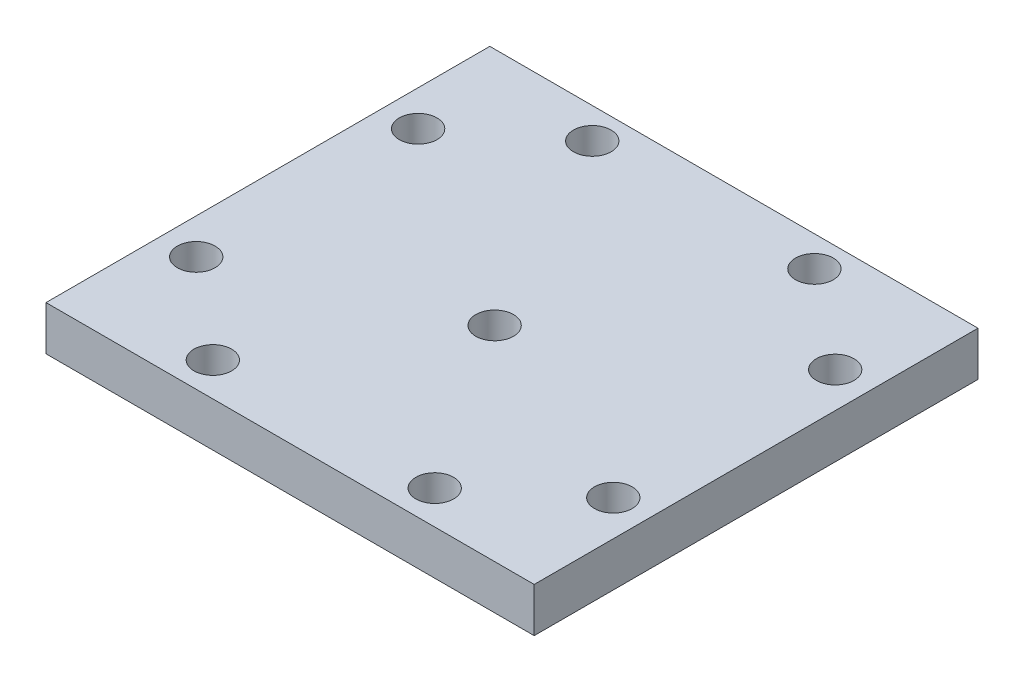
ISO-10303-21;
HEADER;
FILE_DESCRIPTION(('STEP AP214'),'2;1');
FILE_NAME('part.step','',(''),(''),'','','');
FILE_SCHEMA(('AUTOMOTIVE_DESIGN { 1 0 10303 214 1 1 1 1 }'));
ENDSEC;
DATA;
#1=APPLICATION_CONTEXT('core data for automotive mechanical design processes');
#2=APPLICATION_PROTOCOL_DEFINITION('international standard','automotive_design',2000,#1);
#3=PRODUCT_CONTEXT('',#1,'mechanical');
#4=PRODUCT('Part','Part','',(#3));
#5=PRODUCT_RELATED_PRODUCT_CATEGORY('part','',(#4));
#6=PRODUCT_DEFINITION_FORMATION('','',#4);
#7=PRODUCT_DEFINITION_CONTEXT('part definition',#1,'design');
#8=PRODUCT_DEFINITION('design','',#6,#7);
#9=PRODUCT_DEFINITION_SHAPE('','',#8);
#10=(LENGTH_UNIT() NAMED_UNIT(*) SI_UNIT(.MILLI.,.METRE.));
#11=(NAMED_UNIT(*) PLANE_ANGLE_UNIT() SI_UNIT($,.RADIAN.));
#12=(NAMED_UNIT(*) SI_UNIT($,.STERADIAN.) SOLID_ANGLE_UNIT());
#13=UNCERTAINTY_MEASURE_WITH_UNIT(LENGTH_MEASURE(1.E-05),#10,'distance_accuracy_value','');
#14=(GEOMETRIC_REPRESENTATION_CONTEXT(3) GLOBAL_UNCERTAINTY_ASSIGNED_CONTEXT((#13)) GLOBAL_UNIT_ASSIGNED_CONTEXT((#10,
#11,#12)) REPRESENTATION_CONTEXT('',''));
#15=CARTESIAN_POINT('',(0.,0.,0.));
#16=DIRECTION('',(0.,0.,1.));
#17=DIRECTION('',(1.,0.,0.));
#18=AXIS2_PLACEMENT_3D('',#15,#16,#17);
#19=CARTESIAN_POINT('',(0.,35.,0.));
#20=DIRECTION('',(0.,-1.,0.));
#21=DIRECTION('',(0.,0.,-1.));
#22=AXIS2_PLACEMENT_3D('',#19,#20,#21);
#23=PLANE('',#22);
#24=CARTESIAN_POINT('',(-23.4936005393496,35.,10.125));
#25=DIRECTION('',(0.,-1.,0.));
#26=DIRECTION('',(0.,0.,-1.));
#27=AXIS2_PLACEMENT_3D('',#24,#25,#26);
#28=CIRCLE('',#27,2.125);
#29=CARTESIAN_POINT('',(-23.4936005393496,35.,8.));
#30=VERTEX_POINT('',#29);
#31=EDGE_CURVE('E162',#30,#30,#28,.T.);
#32=ORIENTED_EDGE('',*,*,#31,.T.);
#33=EDGE_LOOP('',(#32));
#34=FACE_BOUND('',#33,.T.);
#35=CARTESIAN_POINT('',(12.5,35.,-23.5265194709854));
#36=DIRECTION('',(0.,-1.,0.));
#37=DIRECTION('',(0.,0.,-1.));
#38=AXIS2_PLACEMENT_3D('',#35,#36,#37);
#39=CIRCLE('',#38,2.125);
#40=CARTESIAN_POINT('',(12.5,35.,-25.6515194709854));
#41=VERTEX_POINT('',#40);
#42=EDGE_CURVE('E151',#41,#41,#39,.T.);
#43=ORIENTED_EDGE('',*,*,#42,.T.);
#44=EDGE_LOOP('',(#43));
#45=FACE_BOUND('',#44,.T.);
#46=CARTESIAN_POINT('',(-12.5,35.,-23.5));
#47=DIRECTION('',(0.,-1.,0.));
#48=DIRECTION('',(0.,0.,-1.));
#49=AXIS2_PLACEMENT_3D('',#46,#47,#48);
#50=CIRCLE('',#49,2.125);
#51=CARTESIAN_POINT('',(-12.5,35.,-25.625));
#52=VERTEX_POINT('',#51);
#53=EDGE_CURVE('E150',#52,#52,#50,.T.);
#54=ORIENTED_EDGE('',*,*,#53,.T.);
#55=EDGE_LOOP('',(#54));
#56=FACE_BOUND('',#55,.T.);
#57=CARTESIAN_POINT('',(12.5,35.,19.25));
#58=DIRECTION('',(0.,-1.,0.));
#59=DIRECTION('',(0.,0.,-1.));
#60=AXIS2_PLACEMENT_3D('',#57,#58,#59);
#61=CIRCLE('',#60,2.125);
#62=CARTESIAN_POINT('',(12.5,35.,17.125));
#63=VERTEX_POINT('',#62);
#64=EDGE_CURVE('E144',#63,#63,#61,.T.);
#65=ORIENTED_EDGE('',*,*,#64,.T.);
#66=EDGE_LOOP('',(#65));
#67=FACE_BOUND('',#66,.T.);
#68=CARTESIAN_POINT('',(-23.4936005393496,35.,-14.875));
#69=DIRECTION('',(0.,-1.,0.));
#70=DIRECTION('',(0.,0.,-1.));
#71=AXIS2_PLACEMENT_3D('',#68,#69,#70);
#72=CIRCLE('',#71,2.125);
#73=CARTESIAN_POINT('',(-23.4936005393496,35.,-17.));
#74=VERTEX_POINT('',#73);
#75=EDGE_CURVE('E163',#74,#74,#72,.T.);
#76=ORIENTED_EDGE('',*,*,#75,.T.);
#77=EDGE_LOOP('',(#76));
#78=FACE_BOUND('',#77,.T.);
#79=CARTESIAN_POINT('',(23.4936005393496,35.,-14.875));
#80=DIRECTION('',(0.,-1.,0.));
#81=DIRECTION('',(0.,0.,1.));
#82=AXIS2_PLACEMENT_3D('',#79,#80,#81);
#83=CIRCLE('',#82,2.125);
#84=CARTESIAN_POINT('',(23.4936005393496,35.,-12.75));
#85=VERTEX_POINT('',#84);
#86=EDGE_CURVE('E180',#85,#85,#83,.T.);
#87=ORIENTED_EDGE('',*,*,#86,.T.);
#88=EDGE_LOOP('',(#87));
#89=FACE_BOUND('',#88,.T.);
#90=CARTESIAN_POINT('',(23.4936005393496,35.,10.125));
#91=DIRECTION('',(0.,-1.,0.));
#92=DIRECTION('',(0.,0.,1.));
#93=AXIS2_PLACEMENT_3D('',#90,#91,#92);
#94=CIRCLE('',#93,2.125);
#95=CARTESIAN_POINT('',(23.4936005393496,35.,12.25));
#96=VERTEX_POINT('',#95);
#97=EDGE_CURVE('E174',#96,#96,#94,.T.);
#98=ORIENTED_EDGE('',*,*,#97,.T.);
#99=EDGE_LOOP('',(#98));
#100=FACE_BOUND('',#99,.T.);
#101=CARTESIAN_POINT('',(-12.5,35.,19.25));
#102=DIRECTION('',(0.,-1.,0.));
#103=DIRECTION('',(0.,0.,-1.));
#104=AXIS2_PLACEMENT_3D('',#101,#102,#103);
#105=CIRCLE('',#104,2.125);
#106=CARTESIAN_POINT('',(-12.5,35.,17.125));
#107=VERTEX_POINT('',#106);
#108=EDGE_CURVE('E138',#107,#107,#105,.T.);
#109=ORIENTED_EDGE('',*,*,#108,.T.);
#110=EDGE_LOOP('',(#109));
#111=FACE_BOUND('',#110,.T.);
#112=DIRECTION('',(0.,0.,-1.));
#113=VECTOR('',#112,1.);
#114=CARTESIAN_POINT('',(27.5,35.,23.0435212218331));
#115=LINE('',#114,#113);
#116=CARTESIAN_POINT('',(27.5,35.,23.0435212218331));
#117=VERTEX_POINT('',#116);
#118=CARTESIAN_POINT('',(27.5,35.,-26.9564787781669));
#119=VERTEX_POINT('',#118);
#120=EDGE_CURVE('E108',#117,#119,#115,.T.);
#121=ORIENTED_EDGE('',*,*,#120,.T.);
#122=DIRECTION('',(-1.,0.,0.));
#123=VECTOR('',#122,1.);
#124=CARTESIAN_POINT('',(-27.5,35.,-26.9564787781669));
#125=LINE('',#124,#123);
#126=CARTESIAN_POINT('',(-27.5,35.,-26.9564787781669));
#127=VERTEX_POINT('',#126);
#128=EDGE_CURVE('E103',#119,#127,#125,.T.);
#129=ORIENTED_EDGE('',*,*,#128,.T.);
#130=DIRECTION('',(0.,0.,1.));
#131=VECTOR('',#130,1.);
#132=CARTESIAN_POINT('',(-27.5,35.,23.0435212218331));
#133=LINE('',#132,#131);
#134=CARTESIAN_POINT('',(-27.5,35.,23.0435212218331));
#135=VERTEX_POINT('',#134);
#136=EDGE_CURVE('E106',#127,#135,#133,.T.);
#137=ORIENTED_EDGE('',*,*,#136,.T.);
#138=DIRECTION('',(1.,0.,0.));
#139=VECTOR('',#138,1.);
#140=CARTESIAN_POINT('',(-27.5,35.,23.0435212218331));
#141=LINE('',#140,#139);
#142=EDGE_CURVE('E73',#135,#117,#141,.T.);
#143=ORIENTED_EDGE('',*,*,#142,.T.);
#144=EDGE_LOOP('',(#121,#129,#137,#143));
#145=FACE_BOUND('',#144,.T.);
#146=CARTESIAN_POINT('',(0.,35.,0.));
#147=DIRECTION('',(0.,1.,0.));
#148=DIRECTION('',(0.,0.,1.));
#149=AXIS2_PLACEMENT_3D('',#146,#147,#148);
#150=CIRCLE('',#149,2.125);
#151=CARTESIAN_POINT('',(0.,35.,2.125));
#152=VERTEX_POINT('',#151);
#153=EDGE_CURVE('E123',#152,#152,#150,.T.);
#154=ORIENTED_EDGE('',*,*,#153,.F.);
#155=EDGE_LOOP('',(#154));
#156=FACE_BOUND('',#155,.T.);
#157=ADVANCED_FACE('F56',(#34,#45,#56,#67,#78,#89,#100,#111,#145,#156),#23,.F.);
#158=CARTESIAN_POINT('',(0.,30.,0.));
#159=DIRECTION('',(0.,-1.,0.));
#160=DIRECTION('',(0.,0.,-1.));
#161=AXIS2_PLACEMENT_3D('',#158,#159,#160);
#162=PLANE('',#161);
#163=CARTESIAN_POINT('',(-23.4936005393496,30.,10.125));
#164=DIRECTION('',(0.,-1.,0.));
#165=DIRECTION('',(0.,0.,-1.));
#166=AXIS2_PLACEMENT_3D('',#163,#164,#165);
#167=CIRCLE('',#166,2.125);
#168=CARTESIAN_POINT('',(-23.4936005393496,30.,8.));
#169=VERTEX_POINT('',#168);
#170=EDGE_CURVE('E159',#169,#169,#167,.T.);
#171=ORIENTED_EDGE('',*,*,#170,.F.);
#172=EDGE_LOOP('',(#171));
#173=FACE_BOUND('',#172,.T.);
#174=CARTESIAN_POINT('',(12.5,30.,-23.5265194709854));
#175=DIRECTION('',(0.,-1.,0.));
#176=DIRECTION('',(0.,0.,-1.));
#177=AXIS2_PLACEMENT_3D('',#174,#175,#176);
#178=CIRCLE('',#177,2.125);
#179=CARTESIAN_POINT('',(12.5,30.,-25.6515194709854));
#180=VERTEX_POINT('',#179);
#181=EDGE_CURVE('E166',#180,#180,#178,.T.);
#182=ORIENTED_EDGE('',*,*,#181,.F.);
#183=EDGE_LOOP('',(#182));
#184=FACE_BOUND('',#183,.T.);
#185=CARTESIAN_POINT('',(-12.5,30.,-23.5));
#186=DIRECTION('',(0.,-1.,0.));
#187=DIRECTION('',(0.,0.,-1.));
#188=AXIS2_PLACEMENT_3D('',#185,#186,#187);
#189=CIRCLE('',#188,2.125);
#190=CARTESIAN_POINT('',(-12.5,30.,-25.625));
#191=VERTEX_POINT('',#190);
#192=EDGE_CURVE('E147',#191,#191,#189,.T.);
#193=ORIENTED_EDGE('',*,*,#192,.F.);
#194=EDGE_LOOP('',(#193));
#195=FACE_BOUND('',#194,.T.);
#196=CARTESIAN_POINT('',(12.5,30.,19.25));
#197=DIRECTION('',(0.,-1.,0.));
#198=DIRECTION('',(0.,0.,-1.));
#199=AXIS2_PLACEMENT_3D('',#196,#197,#198);
#200=CIRCLE('',#199,2.125);
#201=CARTESIAN_POINT('',(12.5,30.,17.125));
#202=VERTEX_POINT('',#201);
#203=EDGE_CURVE('E154',#202,#202,#200,.T.);
#204=ORIENTED_EDGE('',*,*,#203,.F.);
#205=EDGE_LOOP('',(#204));
#206=FACE_BOUND('',#205,.T.);
#207=CARTESIAN_POINT('',(-23.4936005393496,30.,-14.875));
#208=DIRECTION('',(0.,-1.,0.));
#209=DIRECTION('',(0.,0.,-1.));
#210=AXIS2_PLACEMENT_3D('',#207,#208,#209);
#211=CIRCLE('',#210,2.125);
#212=CARTESIAN_POINT('',(-23.4936005393496,30.,-17.));
#213=VERTEX_POINT('',#212);
#214=EDGE_CURVE('E183',#213,#213,#211,.T.);
#215=ORIENTED_EDGE('',*,*,#214,.F.);
#216=EDGE_LOOP('',(#215));
#217=FACE_BOUND('',#216,.T.);
#218=CARTESIAN_POINT('',(23.4936005393496,30.,-14.875));
#219=DIRECTION('',(0.,-1.,0.));
#220=DIRECTION('',(0.,0.,1.));
#221=AXIS2_PLACEMENT_3D('',#218,#219,#220);
#222=CIRCLE('',#221,2.125);
#223=CARTESIAN_POINT('',(23.4936005393496,30.,-12.75));
#224=VERTEX_POINT('',#223);
#225=EDGE_CURVE('E177',#224,#224,#222,.T.);
#226=ORIENTED_EDGE('',*,*,#225,.F.);
#227=EDGE_LOOP('',(#226));
#228=FACE_BOUND('',#227,.T.);
#229=CARTESIAN_POINT('',(23.4936005393496,30.,10.125));
#230=DIRECTION('',(0.,-1.,0.));
#231=DIRECTION('',(0.,0.,1.));
#232=AXIS2_PLACEMENT_3D('',#229,#230,#231);
#233=CIRCLE('',#232,2.125);
#234=CARTESIAN_POINT('',(23.4936005393496,30.,12.25));
#235=VERTEX_POINT('',#234);
#236=EDGE_CURVE('E171',#235,#235,#233,.T.);
#237=ORIENTED_EDGE('',*,*,#236,.F.);
#238=EDGE_LOOP('',(#237));
#239=FACE_BOUND('',#238,.T.);
#240=CARTESIAN_POINT('',(-12.5,30.,19.25));
#241=DIRECTION('',(0.,-1.,0.));
#242=DIRECTION('',(0.,0.,-1.));
#243=AXIS2_PLACEMENT_3D('',#240,#241,#242);
#244=CIRCLE('',#243,2.125);
#245=CARTESIAN_POINT('',(-12.5,30.,17.125));
#246=VERTEX_POINT('',#245);
#247=EDGE_CURVE('E141',#246,#246,#244,.T.);
#248=ORIENTED_EDGE('',*,*,#247,.F.);
#249=EDGE_LOOP('',(#248));
#250=FACE_BOUND('',#249,.T.);
#251=DIRECTION('',(0.,0.,-1.));
#252=VECTOR('',#251,1.);
#253=CARTESIAN_POINT('',(27.5,30.,23.0435212218331));
#254=LINE('',#253,#252);
#255=CARTESIAN_POINT('',(27.5,30.,23.0435212218331));
#256=VERTEX_POINT('',#255);
#257=CARTESIAN_POINT('',(27.5,30.,-26.9564787781669));
#258=VERTEX_POINT('',#257);
#259=EDGE_CURVE('E120',#256,#258,#254,.T.);
#260=ORIENTED_EDGE('',*,*,#259,.F.);
#261=DIRECTION('',(1.,0.,0.));
#262=VECTOR('',#261,1.);
#263=CARTESIAN_POINT('',(-27.5,30.,23.0435212218331));
#264=LINE('',#263,#262);
#265=CARTESIAN_POINT('',(-27.5,30.,23.0435212218331));
#266=VERTEX_POINT('',#265);
#267=EDGE_CURVE('E96',#266,#256,#264,.T.);
#268=ORIENTED_EDGE('',*,*,#267,.F.);
#269=DIRECTION('',(0.,0.,1.));
#270=VECTOR('',#269,1.);
#271=CARTESIAN_POINT('',(-27.5,30.,23.0435212218331));
#272=LINE('',#271,#270);
#273=CARTESIAN_POINT('',(-27.5,30.,-26.9564787781669));
#274=VERTEX_POINT('',#273);
#275=EDGE_CURVE('E90',#274,#266,#272,.T.);
#276=ORIENTED_EDGE('',*,*,#275,.F.);
#277=DIRECTION('',(-1.,0.,0.));
#278=VECTOR('',#277,1.);
#279=CARTESIAN_POINT('',(-27.5,30.,-26.9564787781669));
#280=LINE('',#279,#278);
#281=EDGE_CURVE('E112',#258,#274,#280,.T.);
#282=ORIENTED_EDGE('',*,*,#281,.F.);
#283=EDGE_LOOP('',(#260,#268,#276,#282));
#284=FACE_BOUND('',#283,.T.);
#285=CARTESIAN_POINT('',(0.,30.,0.));
#286=DIRECTION('',(0.,1.,0.));
#287=DIRECTION('',(0.,0.,1.));
#288=AXIS2_PLACEMENT_3D('',#285,#286,#287);
#289=CIRCLE('',#288,2.125);
#290=CARTESIAN_POINT('',(0.,30.,2.125));
#291=VERTEX_POINT('',#290);
#292=EDGE_CURVE('E135',#291,#291,#289,.T.);
#293=ORIENTED_EDGE('',*,*,#292,.T.);
#294=EDGE_LOOP('',(#293));
#295=FACE_BOUND('',#294,.T.);
#296=ADVANCED_FACE('F131',(#173,#184,#195,#206,#217,#228,#239,#250,#284,#295),#162,.T.);
#297=CARTESIAN_POINT('',(27.5,35.,23.0435212218331));
#298=DIRECTION('',(-1.,0.,0.));
#299=DIRECTION('',(0.,0.,1.));
#300=AXIS2_PLACEMENT_3D('',#297,#298,#299);
#301=PLANE('',#300);
#302=ORIENTED_EDGE('',*,*,#259,.T.);
#303=DIRECTION('',(0.,-1.,0.));
#304=VECTOR('',#303,1.);
#305=CARTESIAN_POINT('',(27.5,35.,-26.9564787781669));
#306=LINE('',#305,#304);
#307=EDGE_CURVE('E12',#119,#258,#306,.T.);
#308=ORIENTED_EDGE('',*,*,#307,.F.);
#309=ORIENTED_EDGE('',*,*,#120,.F.);
#310=DIRECTION('',(0.,-1.,0.));
#311=VECTOR('',#310,1.);
#312=CARTESIAN_POINT('',(27.5,35.,23.0435212218331));
#313=LINE('',#312,#311);
#314=EDGE_CURVE('E116',#117,#256,#313,.T.);
#315=ORIENTED_EDGE('',*,*,#314,.T.);
#316=EDGE_LOOP('',(#302,#308,#309,#315));
#317=FACE_BOUND('',#316,.T.);
#318=ADVANCED_FACE('F58',(#317),#301,.F.);
#319=CARTESIAN_POINT('',(-27.5,35.,-26.9564787781669));
#320=DIRECTION('',(0.,0.,1.));
#321=DIRECTION('',(1.,0.,0.));
#322=AXIS2_PLACEMENT_3D('',#319,#320,#321);
#323=PLANE('',#322);
#324=ORIENTED_EDGE('',*,*,#281,.T.);
#325=DIRECTION('',(0.,-1.,0.));
#326=VECTOR('',#325,1.);
#327=CARTESIAN_POINT('',(-27.5,35.,-26.9564787781669));
#328=LINE('',#327,#326);
#329=EDGE_CURVE('E65',#127,#274,#328,.T.);
#330=ORIENTED_EDGE('',*,*,#329,.F.);
#331=ORIENTED_EDGE('',*,*,#128,.F.);
#332=ORIENTED_EDGE('',*,*,#307,.T.);
#333=EDGE_LOOP('',(#324,#330,#331,#332));
#334=FACE_BOUND('',#333,.T.);
#335=ADVANCED_FACE('F111',(#334),#323,.F.);
#336=CARTESIAN_POINT('',(-27.5,35.,23.0435212218331));
#337=DIRECTION('',(1.,0.,0.));
#338=DIRECTION('',(0.,0.,-1.));
#339=AXIS2_PLACEMENT_3D('',#336,#337,#338);
#340=PLANE('',#339);
#341=ORIENTED_EDGE('',*,*,#275,.T.);
#342=DIRECTION('',(0.,-1.,0.));
#343=VECTOR('',#342,1.);
#344=CARTESIAN_POINT('',(-27.5,35.,23.0435212218331));
#345=LINE('',#344,#343);
#346=EDGE_CURVE('E113',#135,#266,#345,.T.);
#347=ORIENTED_EDGE('',*,*,#346,.F.);
#348=ORIENTED_EDGE('',*,*,#136,.F.);
#349=ORIENTED_EDGE('',*,*,#329,.T.);
#350=EDGE_LOOP('',(#341,#347,#348,#349));
#351=FACE_BOUND('',#350,.T.);
#352=ADVANCED_FACE('F114',(#351),#340,.F.);
#353=CARTESIAN_POINT('',(-27.5,35.,23.0435212218331));
#354=DIRECTION('',(0.,0.,-1.));
#355=DIRECTION('',(-1.,0.,0.));
#356=AXIS2_PLACEMENT_3D('',#353,#354,#355);
#357=PLANE('',#356);
#358=ORIENTED_EDGE('',*,*,#267,.T.);
#359=ORIENTED_EDGE('',*,*,#314,.F.);
#360=ORIENTED_EDGE('',*,*,#142,.F.);
#361=ORIENTED_EDGE('',*,*,#346,.T.);
#362=EDGE_LOOP('',(#358,#359,#360,#361));
#363=FACE_BOUND('',#362,.T.);
#364=ADVANCED_FACE('F128',(#363),#357,.F.);
#365=CARTESIAN_POINT('',(0.,35.,0.));
#366=DIRECTION('',(0.,-1.,0.));
#367=DIRECTION('',(0.,0.,-1.));
#368=AXIS2_PLACEMENT_3D('',#365,#366,#367);
#369=CYLINDRICAL_SURFACE('',#368,2.125);
#370=ORIENTED_EDGE('',*,*,#153,.T.);
#371=EDGE_LOOP('',(#370));
#372=FACE_BOUND('',#371,.T.);
#373=ORIENTED_EDGE('',*,*,#292,.F.);
#374=EDGE_LOOP('',(#373));
#375=FACE_BOUND('',#374,.T.);
#376=ADVANCED_FACE('F212',(#372,#375),#369,.F.);
#377=CARTESIAN_POINT('',(-12.5,35.,19.25));
#378=DIRECTION('',(0.,-1.,0.));
#379=DIRECTION('',(0.,0.,-1.));
#380=AXIS2_PLACEMENT_3D('',#377,#378,#379);
#381=CYLINDRICAL_SURFACE('',#380,2.125);
#382=ORIENTED_EDGE('',*,*,#108,.F.);
#383=EDGE_LOOP('',(#382));
#384=FACE_BOUND('',#383,.T.);
#385=ORIENTED_EDGE('',*,*,#247,.T.);
#386=EDGE_LOOP('',(#385));
#387=FACE_BOUND('',#386,.T.);
#388=ADVANCED_FACE('F209',(#384,#387),#381,.F.);
#389=CARTESIAN_POINT('',(23.4936005393496,35.,10.125));
#390=DIRECTION('',(0.,-1.,0.));
#391=DIRECTION('',(0.,0.,-1.));
#392=AXIS2_PLACEMENT_3D('',#389,#390,#391);
#393=CYLINDRICAL_SURFACE('',#392,2.125);
#394=ORIENTED_EDGE('',*,*,#97,.F.);
#395=EDGE_LOOP('',(#394));
#396=FACE_BOUND('',#395,.T.);
#397=ORIENTED_EDGE('',*,*,#236,.T.);
#398=EDGE_LOOP('',(#397));
#399=FACE_BOUND('',#398,.T.);
#400=ADVANCED_FACE('F211',(#396,#399),#393,.F.);
#401=CARTESIAN_POINT('',(23.4936005393496,35.,-14.875));
#402=DIRECTION('',(0.,-1.,0.));
#403=DIRECTION('',(0.,0.,-1.));
#404=AXIS2_PLACEMENT_3D('',#401,#402,#403);
#405=CYLINDRICAL_SURFACE('',#404,2.125);
#406=ORIENTED_EDGE('',*,*,#86,.F.);
#407=EDGE_LOOP('',(#406));
#408=FACE_BOUND('',#407,.T.);
#409=ORIENTED_EDGE('',*,*,#225,.T.);
#410=EDGE_LOOP('',(#409));
#411=FACE_BOUND('',#410,.T.);
#412=ADVANCED_FACE('F195',(#408,#411),#405,.F.);
#413=CARTESIAN_POINT('',(-23.4936005393496,35.,-14.875));
#414=DIRECTION('',(0.,-1.,0.));
#415=DIRECTION('',(0.,0.,-1.));
#416=AXIS2_PLACEMENT_3D('',#413,#414,#415);
#417=CYLINDRICAL_SURFACE('',#416,2.125);
#418=ORIENTED_EDGE('',*,*,#75,.F.);
#419=EDGE_LOOP('',(#418));
#420=FACE_BOUND('',#419,.T.);
#421=ORIENTED_EDGE('',*,*,#214,.T.);
#422=EDGE_LOOP('',(#421));
#423=FACE_BOUND('',#422,.T.);
#424=ADVANCED_FACE('F191',(#420,#423),#417,.F.);
#425=CARTESIAN_POINT('',(12.5,35.,19.25));
#426=DIRECTION('',(0.,-1.,0.));
#427=DIRECTION('',(0.,0.,-1.));
#428=AXIS2_PLACEMENT_3D('',#425,#426,#427);
#429=CYLINDRICAL_SURFACE('',#428,2.125);
#430=ORIENTED_EDGE('',*,*,#64,.F.);
#431=EDGE_LOOP('',(#430));
#432=FACE_BOUND('',#431,.T.);
#433=ORIENTED_EDGE('',*,*,#203,.T.);
#434=EDGE_LOOP('',(#433));
#435=FACE_BOUND('',#434,.T.);
#436=ADVANCED_FACE('F194',(#432,#435),#429,.F.);
#437=CARTESIAN_POINT('',(-12.5,35.,-23.5));
#438=DIRECTION('',(0.,-1.,0.));
#439=DIRECTION('',(0.,0.,-1.));
#440=AXIS2_PLACEMENT_3D('',#437,#438,#439);
#441=CYLINDRICAL_SURFACE('',#440,2.125);
#442=ORIENTED_EDGE('',*,*,#53,.F.);
#443=EDGE_LOOP('',(#442));
#444=FACE_BOUND('',#443,.T.);
#445=ORIENTED_EDGE('',*,*,#192,.T.);
#446=EDGE_LOOP('',(#445));
#447=FACE_BOUND('',#446,.T.);
#448=ADVANCED_FACE('F283',(#444,#447),#441,.F.);
#449=CARTESIAN_POINT('',(12.5,35.,-23.5265194709854));
#450=DIRECTION('',(0.,-1.,0.));
#451=DIRECTION('',(0.,0.,-1.));
#452=AXIS2_PLACEMENT_3D('',#449,#450,#451);
#453=CYLINDRICAL_SURFACE('',#452,2.125);
#454=ORIENTED_EDGE('',*,*,#42,.F.);
#455=EDGE_LOOP('',(#454));
#456=FACE_BOUND('',#455,.T.);
#457=ORIENTED_EDGE('',*,*,#181,.T.);
#458=EDGE_LOOP('',(#457));
#459=FACE_BOUND('',#458,.T.);
#460=ADVANCED_FACE('F293',(#456,#459),#453,.F.);
#461=CARTESIAN_POINT('',(-23.4936005393496,35.,10.125));
#462=DIRECTION('',(0.,-1.,0.));
#463=DIRECTION('',(0.,0.,-1.));
#464=AXIS2_PLACEMENT_3D('',#461,#462,#463);
#465=CYLINDRICAL_SURFACE('',#464,2.125);
#466=ORIENTED_EDGE('',*,*,#31,.F.);
#467=EDGE_LOOP('',(#466));
#468=FACE_BOUND('',#467,.T.);
#469=ORIENTED_EDGE('',*,*,#170,.T.);
#470=EDGE_LOOP('',(#469));
#471=FACE_BOUND('',#470,.T.);
#472=ADVANCED_FACE('F302',(#468,#471),#465,.F.);
#473=CLOSED_SHELL('',(#157,#296,#318,#335,#352,#364,#376,#388,#400,#412,#424,#436,#448,#460,#472));
#474=MANIFOLD_SOLID_BREP('B2',#473);
#475=ADVANCED_BREP_SHAPE_REPRESENTATION('',(#18,#474),#14);
#476=SHAPE_DEFINITION_REPRESENTATION(#9,#475);
ENDSEC;
END-ISO-10303-21;
